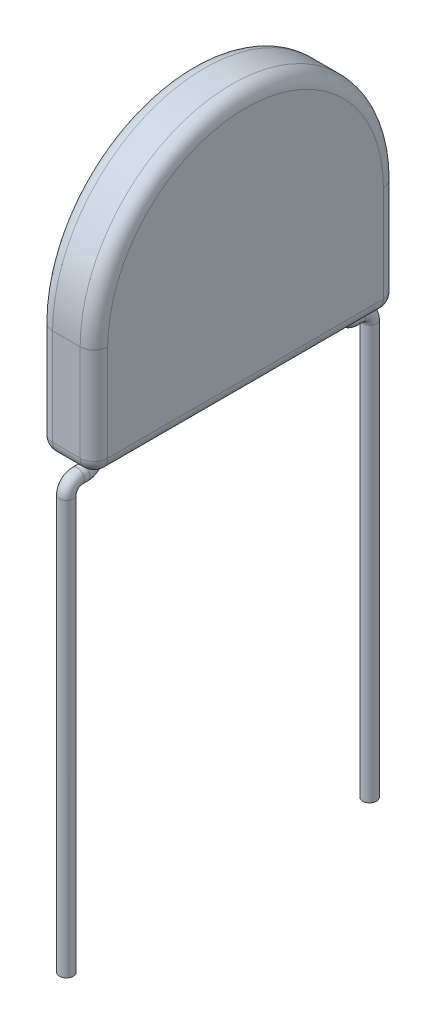
ISO-10303-21;
HEADER;
FILE_DESCRIPTION(('STEP AP214'),'2;1');
FILE_NAME('part.step','',(''),(''),'','','');
FILE_SCHEMA(('AUTOMOTIVE_DESIGN { 1 0 10303 214 1 1 1 1 }'));
ENDSEC;
DATA;
#1=APPLICATION_CONTEXT('core data for automotive mechanical design processes');
#2=APPLICATION_PROTOCOL_DEFINITION('international standard','automotive_design',2000,#1);
#3=PRODUCT_CONTEXT('',#1,'mechanical');
#4=PRODUCT('Part','Part','',(#3));
#5=PRODUCT_RELATED_PRODUCT_CATEGORY('part','',(#4));
#6=PRODUCT_DEFINITION_FORMATION('','',#4);
#7=PRODUCT_DEFINITION_CONTEXT('part definition',#1,'design');
#8=PRODUCT_DEFINITION('design','',#6,#7);
#9=PRODUCT_DEFINITION_SHAPE('','',#8);
#10=(LENGTH_UNIT() NAMED_UNIT(*) SI_UNIT(.MILLI.,.METRE.));
#11=(NAMED_UNIT(*) PLANE_ANGLE_UNIT() SI_UNIT($,.RADIAN.));
#12=(NAMED_UNIT(*) SI_UNIT($,.STERADIAN.) SOLID_ANGLE_UNIT());
#13=UNCERTAINTY_MEASURE_WITH_UNIT(LENGTH_MEASURE(1.E-05),#10,'distance_accuracy_value','');
#14=(GEOMETRIC_REPRESENTATION_CONTEXT(3) GLOBAL_UNCERTAINTY_ASSIGNED_CONTEXT((#13)) GLOBAL_UNIT_ASSIGNED_CONTEXT((#10,
#11,#12)) REPRESENTATION_CONTEXT('',''));
#15=CARTESIAN_POINT('',(0.,0.,0.));
#16=DIRECTION('',(0.,0.,1.));
#17=DIRECTION('',(1.,0.,0.));
#18=AXIS2_PLACEMENT_3D('',#15,#16,#17);
#19=CARTESIAN_POINT('',(1.,0.,0.));
#20=DIRECTION('',(0.,1.,0.));
#21=DIRECTION('',(0.,0.,1.));
#22=AXIS2_PLACEMENT_3D('',#19,#20,#21);
#23=PLANE('',#22);
#24=CARTESIAN_POINT('',(0.5,0.,-5.));
#25=DIRECTION('',(0.,1.,0.));
#26=DIRECTION('',(0.,0.,1.));
#27=AXIS2_PLACEMENT_3D('',#24,#25,#26);
#28=CIRCLE('',#27,0.125);
#29=CARTESIAN_POINT('',(0.5,0.,-4.875));
#30=VERTEX_POINT('',#29);
#31=EDGE_CURVE('E630',#30,#30,#28,.T.);
#32=ORIENTED_EDGE('',*,*,#31,.T.);
#33=EDGE_LOOP('',(#32));
#34=FACE_BOUND('',#33,.T.);
#35=DIRECTION('',(0.,0.,-1.));
#36=VECTOR('',#35,1.);
#37=CARTESIAN_POINT('',(0.25,0.,0.));
#38=LINE('',#37,#36);
#39=CARTESIAN_POINT('',(0.25,0.,-0.25));
#40=VERTEX_POINT('',#39);
#41=CARTESIAN_POINT('',(0.25,0.,-5.25));
#42=VERTEX_POINT('',#41);
#43=EDGE_CURVE('E51',#40,#42,#38,.T.);
#44=ORIENTED_EDGE('',*,*,#43,.T.);
#45=DIRECTION('',(-1.,0.,0.));
#46=VECTOR('',#45,1.);
#47=CARTESIAN_POINT('',(1.,0.,-5.25));
#48=LINE('',#47,#46);
#49=CARTESIAN_POINT('',(0.75,0.,-5.25));
#50=VERTEX_POINT('',#49);
#51=EDGE_CURVE('E44',#42,#50,#48,.F.);
#52=ORIENTED_EDGE('',*,*,#51,.T.);
#53=DIRECTION('',(0.,0.,-1.));
#54=VECTOR('',#53,1.);
#55=CARTESIAN_POINT('',(0.75,0.,0.));
#56=LINE('',#55,#54);
#57=CARTESIAN_POINT('',(0.75,0.,-0.25));
#58=VERTEX_POINT('',#57);
#59=EDGE_CURVE('E59',#50,#58,#56,.F.);
#60=ORIENTED_EDGE('',*,*,#59,.T.);
#61=DIRECTION('',(-1.,0.,0.));
#62=VECTOR('',#61,1.);
#63=CARTESIAN_POINT('',(1.,0.,-0.25));
#64=LINE('',#63,#62);
#65=EDGE_CURVE('E190',#58,#40,#64,.T.);
#66=ORIENTED_EDGE('',*,*,#65,.T.);
#67=EDGE_LOOP('',(#44,#52,#60,#66));
#68=FACE_BOUND('',#67,.T.);
#69=CARTESIAN_POINT('',(0.5,0.,-0.5));
#70=DIRECTION('',(0.,1.,0.));
#71=DIRECTION('',(0.,0.,1.));
#72=AXIS2_PLACEMENT_3D('',#69,#70,#71);
#73=CIRCLE('',#72,0.125);
#74=CARTESIAN_POINT('',(0.5,0.,-0.375));
#75=VERTEX_POINT('',#74);
#76=EDGE_CURVE('E11',#75,#75,#73,.F.);
#77=ORIENTED_EDGE('',*,*,#76,.F.);
#78=EDGE_LOOP('',(#77));
#79=FACE_BOUND('',#78,.T.);
#80=ADVANCED_FACE('F36',(#34,#68,#79),#23,.F.);
#81=CARTESIAN_POINT('',(1.,2.,-2.75));
#82=DIRECTION('',(-1.,0.,0.));
#83=DIRECTION('',(0.,0.,1.));
#84=AXIS2_PLACEMENT_3D('',#81,#82,#83);
#85=CYLINDRICAL_SURFACE('',#84,2.75);
#86=DIRECTION('',(-1.,0.,0.));
#87=VECTOR('',#86,1.);
#88=CARTESIAN_POINT('',(1.,2.,-5.5));
#89=LINE('',#88,#87);
#90=CARTESIAN_POINT('',(0.75,2.,-5.5));
#91=VERTEX_POINT('',#90);
#92=CARTESIAN_POINT('',(0.25,2.,-5.5));
#93=VERTEX_POINT('',#92);
#94=EDGE_CURVE('E137',#91,#93,#89,.T.);
#95=ORIENTED_EDGE('',*,*,#94,.T.);
#96=CARTESIAN_POINT('',(0.25,2.,-2.75));
#97=DIRECTION('',(1.,0.,0.));
#98=DIRECTION('',(0.,0.,-1.));
#99=AXIS2_PLACEMENT_3D('',#96,#97,#98);
#100=CIRCLE('',#99,2.75);
#101=CARTESIAN_POINT('',(0.25,2.,0.));
#102=VERTEX_POINT('',#101);
#103=EDGE_CURVE('E136',#93,#102,#100,.T.);
#104=ORIENTED_EDGE('',*,*,#103,.T.);
#105=DIRECTION('',(-1.,0.,0.));
#106=VECTOR('',#105,1.);
#107=CARTESIAN_POINT('',(1.,2.,0.));
#108=LINE('',#107,#106);
#109=CARTESIAN_POINT('',(0.75,2.,0.));
#110=VERTEX_POINT('',#109);
#111=EDGE_CURVE('E119',#110,#102,#108,.T.);
#112=ORIENTED_EDGE('',*,*,#111,.F.);
#113=CARTESIAN_POINT('',(0.75,2.,-2.75));
#114=DIRECTION('',(1.,0.,0.));
#115=DIRECTION('',(0.,0.,-1.));
#116=AXIS2_PLACEMENT_3D('',#113,#114,#115);
#117=CIRCLE('',#116,2.75);
#118=EDGE_CURVE('E133',#110,#91,#117,.F.);
#119=ORIENTED_EDGE('',*,*,#118,.T.);
#120=EDGE_LOOP('',(#95,#104,#112,#119));
#121=FACE_BOUND('',#120,.T.);
#122=ADVANCED_FACE('F132',(#121),#85,.T.);
#123=CARTESIAN_POINT('',(1.,2.,0.));
#124=DIRECTION('',(0.,0.,-1.));
#125=DIRECTION('',(0.,1.,0.));
#126=AXIS2_PLACEMENT_3D('',#123,#124,#125);
#127=PLANE('',#126);
#128=ORIENTED_EDGE('',*,*,#111,.T.);
#129=DIRECTION('',(0.,-1.,0.));
#130=VECTOR('',#129,1.);
#131=CARTESIAN_POINT('',(0.25,2.,0.));
#132=LINE('',#131,#130);
#133=CARTESIAN_POINT('',(0.25,0.25,0.));
#134=VERTEX_POINT('',#133);
#135=EDGE_CURVE('E127',#102,#134,#132,.T.);
#136=ORIENTED_EDGE('',*,*,#135,.T.);
#137=DIRECTION('',(-1.,0.,0.));
#138=VECTOR('',#137,1.);
#139=CARTESIAN_POINT('',(1.,0.25,0.));
#140=LINE('',#139,#138);
#141=CARTESIAN_POINT('',(0.75,0.25,0.));
#142=VERTEX_POINT('',#141);
#143=EDGE_CURVE('E122',#134,#142,#140,.F.);
#144=ORIENTED_EDGE('',*,*,#143,.T.);
#145=DIRECTION('',(0.,-1.,0.));
#146=VECTOR('',#145,1.);
#147=CARTESIAN_POINT('',(0.75,2.,0.));
#148=LINE('',#147,#146);
#149=EDGE_CURVE('E115',#142,#110,#148,.F.);
#150=ORIENTED_EDGE('',*,*,#149,.T.);
#151=EDGE_LOOP('',(#128,#136,#144,#150));
#152=FACE_BOUND('',#151,.T.);
#153=ADVANCED_FACE('F117',(#152),#127,.F.);
#154=CARTESIAN_POINT('',(1.,0.,-5.5));
#155=DIRECTION('',(0.,0.,1.));
#156=DIRECTION('',(0.,-1.,0.));
#157=AXIS2_PLACEMENT_3D('',#154,#155,#156);
#158=PLANE('',#157);
#159=ORIENTED_EDGE('',*,*,#94,.F.);
#160=DIRECTION('',(0.,1.,0.));
#161=VECTOR('',#160,1.);
#162=CARTESIAN_POINT('',(0.75,0.,-5.5));
#163=LINE('',#162,#161);
#164=CARTESIAN_POINT('',(0.75,0.25,-5.5));
#165=VERTEX_POINT('',#164);
#166=EDGE_CURVE('E188',#91,#165,#163,.F.);
#167=ORIENTED_EDGE('',*,*,#166,.T.);
#168=DIRECTION('',(-1.,0.,0.));
#169=VECTOR('',#168,1.);
#170=CARTESIAN_POINT('',(1.,0.25,-5.5));
#171=LINE('',#170,#169);
#172=CARTESIAN_POINT('',(0.25,0.25,-5.5));
#173=VERTEX_POINT('',#172);
#174=EDGE_CURVE('E184',#165,#173,#171,.T.);
#175=ORIENTED_EDGE('',*,*,#174,.T.);
#176=DIRECTION('',(0.,1.,0.));
#177=VECTOR('',#176,1.);
#178=CARTESIAN_POINT('',(0.25,0.,-5.5));
#179=LINE('',#178,#177);
#180=EDGE_CURVE('E186',#173,#93,#179,.T.);
#181=ORIENTED_EDGE('',*,*,#180,.T.);
#182=EDGE_LOOP('',(#159,#167,#175,#181));
#183=FACE_BOUND('',#182,.T.);
#184=ADVANCED_FACE('F281',(#183),#158,.F.);
#185=CARTESIAN_POINT('',(1.,2.,-2.75));
#186=DIRECTION('',(1.,0.,0.));
#187=DIRECTION('',(0.,0.,-1.));
#188=AXIS2_PLACEMENT_3D('',#185,#186,#187);
#189=PLANE('',#188);
#190=DIRECTION('',(0.,-1.,0.));
#191=VECTOR('',#190,1.);
#192=CARTESIAN_POINT('',(1.,0.,-0.25));
#193=LINE('',#192,#191);
#194=CARTESIAN_POINT('',(1.,2.,-0.249999999999999));
#195=VERTEX_POINT('',#194);
#196=CARTESIAN_POINT('',(1.,0.25,-0.25));
#197=VERTEX_POINT('',#196);
#198=EDGE_CURVE('E150',#195,#197,#193,.T.);
#199=ORIENTED_EDGE('',*,*,#198,.T.);
#200=DIRECTION('',(0.,0.,-1.));
#201=VECTOR('',#200,1.);
#202=CARTESIAN_POINT('',(1.,0.25,-5.5));
#203=LINE('',#202,#201);
#204=CARTESIAN_POINT('',(1.,0.25,-5.25));
#205=VERTEX_POINT('',#204);
#206=EDGE_CURVE('E182',#197,#205,#203,.T.);
#207=ORIENTED_EDGE('',*,*,#206,.T.);
#208=DIRECTION('',(0.,1.,0.));
#209=VECTOR('',#208,1.);
#210=CARTESIAN_POINT('',(1.,2.,-5.25));
#211=LINE('',#210,#209);
#212=CARTESIAN_POINT('',(1.,2.,-5.25));
#213=VERTEX_POINT('',#212);
#214=EDGE_CURVE('E179',#205,#213,#211,.T.);
#215=ORIENTED_EDGE('',*,*,#214,.T.);
#216=CARTESIAN_POINT('',(1.,2.,-2.75));
#217=DIRECTION('',(1.,0.,0.));
#218=DIRECTION('',(0.,0.,-1.));
#219=AXIS2_PLACEMENT_3D('',#216,#217,#218);
#220=CIRCLE('',#219,2.5);
#221=EDGE_CURVE('E176',#213,#195,#220,.T.);
#222=ORIENTED_EDGE('',*,*,#221,.T.);
#223=EDGE_LOOP('',(#199,#207,#215,#222));
#224=FACE_BOUND('',#223,.T.);
#225=ADVANCED_FACE('F534',(#224),#189,.T.);
#226=CARTESIAN_POINT('',(0.,2.,-2.75));
#227=DIRECTION('',(1.,0.,0.));
#228=DIRECTION('',(0.,0.,-1.));
#229=AXIS2_PLACEMENT_3D('',#226,#227,#228);
#230=PLANE('',#229);
#231=DIRECTION('',(0.,0.,-1.));
#232=VECTOR('',#231,1.);
#233=CARTESIAN_POINT('',(0.,0.25,-2.75));
#234=LINE('',#233,#232);
#235=CARTESIAN_POINT('',(0.,0.25,-5.25));
#236=VERTEX_POINT('',#235);
#237=CARTESIAN_POINT('',(0.,0.25,-0.25));
#238=VERTEX_POINT('',#237);
#239=EDGE_CURVE('E167',#236,#238,#234,.F.);
#240=ORIENTED_EDGE('',*,*,#239,.T.);
#241=DIRECTION('',(0.,-1.,0.));
#242=VECTOR('',#241,1.);
#243=CARTESIAN_POINT('',(0.,2.,-0.25));
#244=LINE('',#243,#242);
#245=CARTESIAN_POINT('',(0.,2.,-0.249999999999999));
#246=VERTEX_POINT('',#245);
#247=EDGE_CURVE('E147',#238,#246,#244,.F.);
#248=ORIENTED_EDGE('',*,*,#247,.T.);
#249=CARTESIAN_POINT('',(0.,2.,-2.75));
#250=DIRECTION('',(1.,0.,0.));
#251=DIRECTION('',(0.,0.,-1.));
#252=AXIS2_PLACEMENT_3D('',#249,#250,#251);
#253=CIRCLE('',#252,2.5);
#254=CARTESIAN_POINT('',(0.,2.,-5.25));
#255=VERTEX_POINT('',#254);
#256=EDGE_CURVE('E171',#246,#255,#253,.F.);
#257=ORIENTED_EDGE('',*,*,#256,.T.);
#258=DIRECTION('',(0.,1.,0.));
#259=VECTOR('',#258,1.);
#260=CARTESIAN_POINT('',(0.,2.,-5.25));
#261=LINE('',#260,#259);
#262=EDGE_CURVE('E169',#255,#236,#261,.F.);
#263=ORIENTED_EDGE('',*,*,#262,.T.);
#264=EDGE_LOOP('',(#240,#248,#257,#263));
#265=FACE_BOUND('',#264,.T.);
#266=ADVANCED_FACE('F254',(#265),#230,.F.);
#267=CARTESIAN_POINT('',(0.75,2.,-5.25));
#268=DIRECTION('',(0.,-1.,0.));
#269=DIRECTION('',(0.,0.,-1.));
#270=AXIS2_PLACEMENT_3D('',#267,#268,#269);
#271=CYLINDRICAL_SURFACE('',#270,0.25);
#272=CARTESIAN_POINT('',(0.75,0.25,-5.25));
#273=DIRECTION('',(0.,-1.,0.));
#274=DIRECTION('',(0.,0.,-1.));
#275=AXIS2_PLACEMENT_3D('',#272,#273,#274);
#276=CIRCLE('',#275,0.25);
#277=EDGE_CURVE('E151',#165,#205,#276,.T.);
#278=ORIENTED_EDGE('',*,*,#277,.F.);
#279=ORIENTED_EDGE('',*,*,#166,.F.);
#280=CARTESIAN_POINT('',(0.75,2.,-5.25));
#281=DIRECTION('',(0.,1.,0.));
#282=DIRECTION('',(0.,0.,1.));
#283=AXIS2_PLACEMENT_3D('',#280,#281,#282);
#284=CIRCLE('',#283,0.25);
#285=EDGE_CURVE('E146',#213,#91,#284,.T.);
#286=ORIENTED_EDGE('',*,*,#285,.F.);
#287=ORIENTED_EDGE('',*,*,#214,.F.);
#288=EDGE_LOOP('',(#278,#279,#286,#287));
#289=FACE_BOUND('',#288,.T.);
#290=ADVANCED_FACE('F38',(#289),#271,.T.);
#291=CARTESIAN_POINT('',(0.75,2.,-2.75));
#292=DIRECTION('',(1.,0.,0.));
#293=DIRECTION('',(0.,0.,-1.));
#294=AXIS2_PLACEMENT_3D('',#291,#292,#293);
#295=TOROIDAL_SURFACE('',#294,2.5,0.25);
#296=ORIENTED_EDGE('',*,*,#285,.T.);
#297=ORIENTED_EDGE('',*,*,#118,.F.);
#298=CARTESIAN_POINT('',(0.75,2.,-0.249999999999999));
#299=DIRECTION('',(0.,-1.,0.));
#300=DIRECTION('',(0.,0.,-1.));
#301=AXIS2_PLACEMENT_3D('',#298,#299,#300);
#302=CIRCLE('',#301,0.25);
#303=EDGE_CURVE('E143',#195,#110,#302,.T.);
#304=ORIENTED_EDGE('',*,*,#303,.F.);
#305=ORIENTED_EDGE('',*,*,#221,.F.);
#306=EDGE_LOOP('',(#296,#297,#304,#305));
#307=FACE_BOUND('',#306,.T.);
#308=ADVANCED_FACE('F142',(#307),#295,.T.);
#309=CARTESIAN_POINT('',(0.75,0.25,-5.25));
#310=DIRECTION('',(0.,0.,1.));
#311=DIRECTION('',(1.,0.,0.));
#312=AXIS2_PLACEMENT_3D('',#309,#310,#311);
#313=SPHERICAL_SURFACE('',#312,0.25);
#314=CARTESIAN_POINT('',(0.75,0.25,-5.25));
#315=DIRECTION('',(1.,0.,0.));
#316=DIRECTION('',(0.,0.,-1.));
#317=AXIS2_PLACEMENT_3D('',#314,#315,#316);
#318=CIRCLE('',#317,0.25);
#319=EDGE_CURVE('E156',#165,#50,#318,.F.);
#320=ORIENTED_EDGE('',*,*,#319,.F.);
#321=ORIENTED_EDGE('',*,*,#277,.T.);
#322=CARTESIAN_POINT('',(0.75,0.25,-5.25));
#323=DIRECTION('',(0.,0.,-1.));
#324=DIRECTION('',(-1.,0.,0.));
#325=AXIS2_PLACEMENT_3D('',#322,#323,#324);
#326=CIRCLE('',#325,0.25);
#327=EDGE_CURVE('E152',#50,#205,#326,.F.);
#328=ORIENTED_EDGE('',*,*,#327,.F.);
#329=EDGE_LOOP('',(#320,#321,#328));
#330=FACE_BOUND('',#329,.T.);
#331=ADVANCED_FACE('F505',(#330),#313,.T.);
#332=CARTESIAN_POINT('',(0.75,2.,-0.25));
#333=DIRECTION('',(0.,1.,0.));
#334=DIRECTION('',(0.,0.,1.));
#335=AXIS2_PLACEMENT_3D('',#332,#333,#334);
#336=CYLINDRICAL_SURFACE('',#335,0.25);
#337=ORIENTED_EDGE('',*,*,#303,.T.);
#338=ORIENTED_EDGE('',*,*,#149,.F.);
#339=CARTESIAN_POINT('',(0.75,0.25,-0.25));
#340=DIRECTION('',(0.,-1.,0.));
#341=DIRECTION('',(0.,0.,-1.));
#342=AXIS2_PLACEMENT_3D('',#339,#340,#341);
#343=CIRCLE('',#342,0.25);
#344=EDGE_CURVE('E223',#197,#142,#343,.T.);
#345=ORIENTED_EDGE('',*,*,#344,.F.);
#346=ORIENTED_EDGE('',*,*,#198,.F.);
#347=EDGE_LOOP('',(#337,#338,#345,#346));
#348=FACE_BOUND('',#347,.T.);
#349=ADVANCED_FACE('F149',(#348),#336,.T.);
#350=CARTESIAN_POINT('',(0.75,0.25,-2.75));
#351=DIRECTION('',(0.,0.,1.));
#352=DIRECTION('',(1.,0.,0.));
#353=AXIS2_PLACEMENT_3D('',#350,#351,#352);
#354=CYLINDRICAL_SURFACE('',#353,0.25);
#355=ORIENTED_EDGE('',*,*,#327,.T.);
#356=ORIENTED_EDGE('',*,*,#206,.F.);
#357=CARTESIAN_POINT('',(0.75,0.25,-0.25));
#358=DIRECTION('',(0.,0.,1.));
#359=DIRECTION('',(1.,0.,0.));
#360=AXIS2_PLACEMENT_3D('',#357,#358,#359);
#361=CIRCLE('',#360,0.25);
#362=EDGE_CURVE('E220',#58,#197,#361,.T.);
#363=ORIENTED_EDGE('',*,*,#362,.F.);
#364=ORIENTED_EDGE('',*,*,#59,.F.);
#365=EDGE_LOOP('',(#355,#356,#363,#364));
#366=FACE_BOUND('',#365,.T.);
#367=ADVANCED_FACE('F235',(#366),#354,.T.);
#368=CARTESIAN_POINT('',(1.,0.25,-5.25));
#369=DIRECTION('',(-1.,0.,0.));
#370=DIRECTION('',(0.,0.,1.));
#371=AXIS2_PLACEMENT_3D('',#368,#369,#370);
#372=CYLINDRICAL_SURFACE('',#371,0.25);
#373=ORIENTED_EDGE('',*,*,#319,.T.);
#374=ORIENTED_EDGE('',*,*,#51,.F.);
#375=CARTESIAN_POINT('',(0.25,0.25,-5.25));
#376=DIRECTION('',(-1.,0.,0.));
#377=DIRECTION('',(0.,0.,1.));
#378=AXIS2_PLACEMENT_3D('',#375,#376,#377);
#379=CIRCLE('',#378,0.25);
#380=EDGE_CURVE('E217',#173,#42,#379,.T.);
#381=ORIENTED_EDGE('',*,*,#380,.F.);
#382=ORIENTED_EDGE('',*,*,#174,.F.);
#383=EDGE_LOOP('',(#373,#374,#381,#382));
#384=FACE_BOUND('',#383,.T.);
#385=ADVANCED_FACE('F228',(#384),#372,.T.);
#386=CARTESIAN_POINT('',(0.75,0.25,-0.25));
#387=DIRECTION('',(0.,0.,1.));
#388=DIRECTION('',(1.,0.,0.));
#389=AXIS2_PLACEMENT_3D('',#386,#387,#388);
#390=SPHERICAL_SURFACE('',#389,0.25);
#391=ORIENTED_EDGE('',*,*,#362,.T.);
#392=ORIENTED_EDGE('',*,*,#344,.T.);
#393=CARTESIAN_POINT('',(0.75,0.25,-0.25));
#394=DIRECTION('',(1.,0.,0.));
#395=DIRECTION('',(0.,0.,-1.));
#396=AXIS2_PLACEMENT_3D('',#393,#394,#395);
#397=CIRCLE('',#396,0.25);
#398=EDGE_CURVE('E211',#58,#142,#397,.F.);
#399=ORIENTED_EDGE('',*,*,#398,.F.);
#400=EDGE_LOOP('',(#391,#392,#399));
#401=FACE_BOUND('',#400,.T.);
#402=ADVANCED_FACE('F237',(#401),#390,.T.);
#403=CARTESIAN_POINT('',(0.25,0.25,-5.25));
#404=DIRECTION('',(0.,0.,1.));
#405=DIRECTION('',(1.,0.,0.));
#406=AXIS2_PLACEMENT_3D('',#403,#404,#405);
#407=SPHERICAL_SURFACE('',#406,0.25);
#408=CARTESIAN_POINT('',(0.25,0.25,-5.25));
#409=DIRECTION('',(0.,0.,-1.));
#410=DIRECTION('',(-1.,0.,0.));
#411=AXIS2_PLACEMENT_3D('',#408,#409,#410);
#412=CIRCLE('',#411,0.25);
#413=EDGE_CURVE('E208',#236,#42,#412,.F.);
#414=ORIENTED_EDGE('',*,*,#413,.F.);
#415=CARTESIAN_POINT('',(0.25,0.25,-5.25));
#416=DIRECTION('',(0.,-1.,0.));
#417=DIRECTION('',(0.,0.,-1.));
#418=AXIS2_PLACEMENT_3D('',#415,#416,#417);
#419=CIRCLE('',#418,0.25);
#420=EDGE_CURVE('E214',#173,#236,#419,.F.);
#421=ORIENTED_EDGE('',*,*,#420,.F.);
#422=ORIENTED_EDGE('',*,*,#380,.T.);
#423=EDGE_LOOP('',(#414,#421,#422));
#424=FACE_BOUND('',#423,.T.);
#425=ADVANCED_FACE('F262',(#424),#407,.T.);
#426=CARTESIAN_POINT('',(0.25,0.,-5.25));
#427=DIRECTION('',(0.,1.,0.));
#428=DIRECTION('',(0.,0.,1.));
#429=AXIS2_PLACEMENT_3D('',#426,#427,#428);
#430=CYLINDRICAL_SURFACE('',#429,0.25);
#431=ORIENTED_EDGE('',*,*,#420,.T.);
#432=ORIENTED_EDGE('',*,*,#262,.F.);
#433=CARTESIAN_POINT('',(0.25,2.,-5.25));
#434=DIRECTION('',(0.,1.,0.));
#435=DIRECTION('',(0.,0.,1.));
#436=AXIS2_PLACEMENT_3D('',#433,#434,#435);
#437=CIRCLE('',#436,0.25);
#438=EDGE_CURVE('E205',#93,#255,#437,.T.);
#439=ORIENTED_EDGE('',*,*,#438,.F.);
#440=ORIENTED_EDGE('',*,*,#180,.F.);
#441=EDGE_LOOP('',(#431,#432,#439,#440));
#442=FACE_BOUND('',#441,.T.);
#443=ADVANCED_FACE('F260',(#442),#430,.T.);
#444=CARTESIAN_POINT('',(1.,0.25,-0.25));
#445=DIRECTION('',(-1.,0.,0.));
#446=DIRECTION('',(0.,0.,1.));
#447=AXIS2_PLACEMENT_3D('',#444,#445,#446);
#448=CYLINDRICAL_SURFACE('',#447,0.25);
#449=ORIENTED_EDGE('',*,*,#398,.T.);
#450=ORIENTED_EDGE('',*,*,#143,.F.);
#451=CARTESIAN_POINT('',(0.25,0.25,-0.25));
#452=DIRECTION('',(-1.,0.,0.));
#453=DIRECTION('',(0.,0.,1.));
#454=AXIS2_PLACEMENT_3D('',#451,#452,#453);
#455=CIRCLE('',#454,0.25);
#456=EDGE_CURVE('E202',#40,#134,#455,.T.);
#457=ORIENTED_EDGE('',*,*,#456,.F.);
#458=ORIENTED_EDGE('',*,*,#65,.F.);
#459=EDGE_LOOP('',(#449,#450,#457,#458));
#460=FACE_BOUND('',#459,.T.);
#461=ADVANCED_FACE('F240',(#460),#448,.T.);
#462=CARTESIAN_POINT('',(0.25,0.25,0.));
#463=DIRECTION('',(0.,0.,-1.));
#464=DIRECTION('',(-1.,0.,0.));
#465=AXIS2_PLACEMENT_3D('',#462,#463,#464);
#466=CYLINDRICAL_SURFACE('',#465,0.25);
#467=ORIENTED_EDGE('',*,*,#413,.T.);
#468=ORIENTED_EDGE('',*,*,#43,.F.);
#469=CARTESIAN_POINT('',(0.25,0.25,-0.25));
#470=DIRECTION('',(0.,0.,1.));
#471=DIRECTION('',(1.,0.,0.));
#472=AXIS2_PLACEMENT_3D('',#469,#470,#471);
#473=CIRCLE('',#472,0.25);
#474=EDGE_CURVE('E199',#238,#40,#473,.T.);
#475=ORIENTED_EDGE('',*,*,#474,.F.);
#476=ORIENTED_EDGE('',*,*,#239,.F.);
#477=EDGE_LOOP('',(#467,#468,#475,#476));
#478=FACE_BOUND('',#477,.T.);
#479=ADVANCED_FACE('F248',(#478),#466,.T.);
#480=CARTESIAN_POINT('',(0.25,2.,-2.75));
#481=DIRECTION('',(1.,0.,0.));
#482=DIRECTION('',(0.,0.,-1.));
#483=AXIS2_PLACEMENT_3D('',#480,#481,#482);
#484=TOROIDAL_SURFACE('',#483,2.5,0.25);
#485=ORIENTED_EDGE('',*,*,#438,.T.);
#486=ORIENTED_EDGE('',*,*,#256,.F.);
#487=CARTESIAN_POINT('',(0.25,2.,-0.25));
#488=DIRECTION('',(0.,-1.,0.));
#489=DIRECTION('',(0.,0.,-1.));
#490=AXIS2_PLACEMENT_3D('',#487,#488,#489);
#491=CIRCLE('',#490,0.25);
#492=EDGE_CURVE('E197',#102,#246,#491,.T.);
#493=ORIENTED_EDGE('',*,*,#492,.F.);
#494=ORIENTED_EDGE('',*,*,#103,.F.);
#495=EDGE_LOOP('',(#485,#486,#493,#494));
#496=FACE_BOUND('',#495,.T.);
#497=ADVANCED_FACE('F290',(#496),#484,.T.);
#498=CARTESIAN_POINT('',(0.25,0.25,-0.25));
#499=DIRECTION('',(0.,0.,1.));
#500=DIRECTION('',(1.,0.,0.));
#501=AXIS2_PLACEMENT_3D('',#498,#499,#500);
#502=SPHERICAL_SURFACE('',#501,0.25);
#503=ORIENTED_EDGE('',*,*,#474,.T.);
#504=ORIENTED_EDGE('',*,*,#456,.T.);
#505=CARTESIAN_POINT('',(0.25,0.25,-0.25));
#506=DIRECTION('',(0.,-1.,0.));
#507=DIRECTION('',(0.,0.,-1.));
#508=AXIS2_PLACEMENT_3D('',#505,#506,#507);
#509=CIRCLE('',#508,0.25);
#510=EDGE_CURVE('E195',#238,#134,#509,.F.);
#511=ORIENTED_EDGE('',*,*,#510,.F.);
#512=EDGE_LOOP('',(#503,#504,#511));
#513=FACE_BOUND('',#512,.T.);
#514=ADVANCED_FACE('F244',(#513),#502,.T.);
#515=CARTESIAN_POINT('',(0.25,2.,-0.25));
#516=DIRECTION('',(0.,-1.,0.));
#517=DIRECTION('',(0.,0.,-1.));
#518=AXIS2_PLACEMENT_3D('',#515,#516,#517);
#519=CYLINDRICAL_SURFACE('',#518,0.25);
#520=ORIENTED_EDGE('',*,*,#492,.T.);
#521=ORIENTED_EDGE('',*,*,#247,.F.);
#522=ORIENTED_EDGE('',*,*,#510,.T.);
#523=ORIENTED_EDGE('',*,*,#135,.F.);
#524=EDGE_LOOP('',(#520,#521,#522,#523));
#525=FACE_BOUND('',#524,.T.);
#526=ADVANCED_FACE('F250',(#525),#519,.T.);
#527=CARTESIAN_POINT('',(0.5,-0.45,0.));
#528=DIRECTION('',(0.,-1.,0.));
#529=DIRECTION('',(0.,0.,-1.));
#530=AXIS2_PLACEMENT_3D('',#527,#528,#529);
#531=CYLINDRICAL_SURFACE('',#530,0.125);
#532=CARTESIAN_POINT('',(0.5,-0.45,0.));
#533=DIRECTION('',(0.,-1.,0.));
#534=DIRECTION('',(0.,0.,-1.));
#535=AXIS2_PLACEMENT_3D('',#532,#533,#534);
#536=CIRCLE('',#535,0.125);
#537=CARTESIAN_POINT('',(0.5,-0.45,0.125));
#538=VERTEX_POINT('',#537);
#539=EDGE_CURVE('E613',#538,#538,#536,.T.);
#540=ORIENTED_EDGE('',*,*,#539,.T.);
#541=EDGE_LOOP('',(#540));
#542=FACE_BOUND('',#541,.T.);
#543=CARTESIAN_POINT('',(0.5,-7.95,0.));
#544=DIRECTION('',(0.,-1.,0.));
#545=DIRECTION('',(0.,0.,-1.));
#546=AXIS2_PLACEMENT_3D('',#543,#544,#545);
#547=CIRCLE('',#546,0.125);
#548=CARTESIAN_POINT('',(0.5,-7.95,-0.125000000000001));
#549=VERTEX_POINT('',#548);
#550=EDGE_CURVE('E162',#549,#549,#547,.T.);
#551=ORIENTED_EDGE('',*,*,#550,.F.);
#552=EDGE_LOOP('',(#551));
#553=FACE_BOUND('',#552,.T.);
#554=ADVANCED_FACE('F287',(#542,#553),#531,.T.);
#555=CARTESIAN_POINT('',(0.5,-0.45,-0.2));
#556=DIRECTION('',(1.,0.,0.));
#557=DIRECTION('',(0.,0.,-1.));
#558=AXIS2_PLACEMENT_3D('',#555,#556,#557);
#559=TOROIDAL_SURFACE('',#558,0.2,0.125);
#560=CARTESIAN_POINT('',(0.5,-0.25,-0.2));
#561=DIRECTION('',(0.,0.,1.));
#562=DIRECTION('',(0.,-1.,0.));
#563=AXIS2_PLACEMENT_3D('',#560,#561,#562);
#564=CIRCLE('',#563,0.125);
#565=CARTESIAN_POINT('',(0.5,-0.125,-0.2));
#566=VERTEX_POINT('',#565);
#567=EDGE_CURVE('E611',#566,#566,#564,.T.);
#568=CARTESIAN_POINT('',(0.5,-0.45,-0.2));
#569=DIRECTION('',(1.,0.,0.));
#570=DIRECTION('',(0.,0.,-1.));
#571=AXIS2_PLACEMENT_3D('',#568,#569,#570);
#572=CIRCLE('',#571,0.325);
#573=EDGE_CURVE('',#566,#538,#572,.T.);
#574=ORIENTED_EDGE('',*,*,#567,.T.);
#575=ORIENTED_EDGE('',*,*,#539,.F.);
#576=ORIENTED_EDGE('',*,*,#573,.T.);
#577=ORIENTED_EDGE('',*,*,#573,.F.);
#578=EDGE_LOOP('',(#574,#576,#575,#577));
#579=FACE_BOUND('',#578,.T.);
#580=ADVANCED_FACE('F329',(#579),#559,.T.);
#581=CARTESIAN_POINT('',(0.5,-0.25,-0.3));
#582=DIRECTION('',(0.,0.,1.));
#583=DIRECTION('',(1.,0.,0.));
#584=AXIS2_PLACEMENT_3D('',#581,#582,#583);
#585=CYLINDRICAL_SURFACE('',#584,0.125);
#586=CARTESIAN_POINT('',(0.5,-0.25,-0.3));
#587=DIRECTION('',(0.,0.,1.));
#588=DIRECTION('',(0.,-1.,0.));
#589=AXIS2_PLACEMENT_3D('',#586,#587,#588);
#590=CIRCLE('',#589,0.125);
#591=CARTESIAN_POINT('',(0.5,-0.375,-0.3));
#592=VERTEX_POINT('',#591);
#593=EDGE_CURVE('E602',#592,#592,#590,.T.);
#594=ORIENTED_EDGE('',*,*,#593,.T.);
#595=EDGE_LOOP('',(#594));
#596=FACE_BOUND('',#595,.T.);
#597=ORIENTED_EDGE('',*,*,#567,.F.);
#598=EDGE_LOOP('',(#597));
#599=FACE_BOUND('',#598,.T.);
#600=ADVANCED_FACE('F337',(#596,#599),#585,.T.);
#601=CARTESIAN_POINT('',(0.5,-0.05,-0.3));
#602=DIRECTION('',(-1.,0.,0.));
#603=DIRECTION('',(0.,0.,1.));
#604=AXIS2_PLACEMENT_3D('',#601,#602,#603);
#605=TOROIDAL_SURFACE('',#604,0.2,0.125);
#606=CARTESIAN_POINT('',(0.5,-0.05,-0.5));
#607=DIRECTION('',(0.,-1.,0.));
#608=DIRECTION('',(0.,0.,-1.));
#609=AXIS2_PLACEMENT_3D('',#606,#607,#608);
#610=CIRCLE('',#609,0.125);
#611=CARTESIAN_POINT('',(0.5,-0.05,-0.625));
#612=VERTEX_POINT('',#611);
#613=EDGE_CURVE('E598',#612,#612,#610,.T.);
#614=CARTESIAN_POINT('',(0.5,-0.05,-0.3));
#615=DIRECTION('',(-1.,0.,0.));
#616=DIRECTION('',(0.,0.,1.));
#617=AXIS2_PLACEMENT_3D('',#614,#615,#616);
#618=CIRCLE('',#617,0.325);
#619=EDGE_CURVE('',#612,#592,#618,.T.);
#620=ORIENTED_EDGE('',*,*,#613,.T.);
#621=ORIENTED_EDGE('',*,*,#593,.F.);
#622=ORIENTED_EDGE('',*,*,#619,.T.);
#623=ORIENTED_EDGE('',*,*,#619,.F.);
#624=EDGE_LOOP('',(#620,#622,#621,#623));
#625=FACE_BOUND('',#624,.T.);
#626=ADVANCED_FACE('F345',(#625),#605,.T.);
#627=CARTESIAN_POINT('',(0.5,-0.05,-0.5));
#628=DIRECTION('',(0.,1.,0.));
#629=DIRECTION('',(0.,0.,1.));
#630=AXIS2_PLACEMENT_3D('',#627,#628,#629);
#631=CYLINDRICAL_SURFACE('',#630,0.125);
#632=ORIENTED_EDGE('',*,*,#613,.F.);
#633=EDGE_LOOP('',(#632));
#634=FACE_BOUND('',#633,.T.);
#635=ORIENTED_EDGE('',*,*,#76,.T.);
#636=EDGE_LOOP('',(#635));
#637=FACE_BOUND('',#636,.T.);
#638=ADVANCED_FACE('F353',(#634,#637),#631,.T.);
#639=CARTESIAN_POINT('',(0.5,-7.95,0.));
#640=DIRECTION('',(0.,-1.,0.));
#641=DIRECTION('',(0.,0.,-1.));
#642=AXIS2_PLACEMENT_3D('',#639,#640,#641);
#643=PLANE('',#642);
#644=ORIENTED_EDGE('',*,*,#550,.T.);
#645=EDGE_LOOP('',(#644));
#646=FACE_BOUND('',#645,.T.);
#647=ADVANCED_FACE('F361',(#646),#643,.T.);
#648=CARTESIAN_POINT('',(0.5,-0.45,-5.5));
#649=DIRECTION('',(0.,-1.,0.));
#650=DIRECTION('',(0.,0.,-1.));
#651=AXIS2_PLACEMENT_3D('',#648,#649,#650);
#652=CYLINDRICAL_SURFACE('',#651,0.125);
#653=CARTESIAN_POINT('',(0.5,-0.45,-5.5));
#654=DIRECTION('',(0.,1.,0.));
#655=DIRECTION('',(0.,0.,1.));
#656=AXIS2_PLACEMENT_3D('',#653,#654,#655);
#657=CIRCLE('',#656,0.125);
#658=CARTESIAN_POINT('',(0.5,-0.45,-5.625));
#659=VERTEX_POINT('',#658);
#660=EDGE_CURVE('E599',#659,#659,#657,.T.);
#661=ORIENTED_EDGE('',*,*,#660,.F.);
#662=EDGE_LOOP('',(#661));
#663=FACE_BOUND('',#662,.T.);
#664=CARTESIAN_POINT('',(0.5,-7.95,-5.5));
#665=DIRECTION('',(0.,1.,0.));
#666=DIRECTION('',(0.,0.,1.));
#667=AXIS2_PLACEMENT_3D('',#664,#665,#666);
#668=CIRCLE('',#667,0.125);
#669=CARTESIAN_POINT('',(0.5,-7.95,-5.375));
#670=VERTEX_POINT('',#669);
#671=EDGE_CURVE('E596',#670,#670,#668,.T.);
#672=ORIENTED_EDGE('',*,*,#671,.T.);
#673=EDGE_LOOP('',(#672));
#674=FACE_BOUND('',#673,.T.);
#675=ADVANCED_FACE('F369',(#663,#674),#652,.T.);
#676=CARTESIAN_POINT('',(0.5,-0.45,-5.3));
#677=DIRECTION('',(-1.,0.,0.));
#678=DIRECTION('',(0.,0.,1.));
#679=AXIS2_PLACEMENT_3D('',#676,#677,#678);
#680=TOROIDAL_SURFACE('',#679,0.2,0.125);
#681=CARTESIAN_POINT('',(0.5,-0.25,-5.3));
#682=DIRECTION('',(0.,0.,1.));
#683=DIRECTION('',(0.,-1.,0.));
#684=AXIS2_PLACEMENT_3D('',#681,#682,#683);
#685=CIRCLE('',#684,0.125);
#686=CARTESIAN_POINT('',(0.5,-0.125,-5.3));
#687=VERTEX_POINT('',#686);
#688=EDGE_CURVE('E605',#687,#687,#685,.T.);
#689=CARTESIAN_POINT('',(0.5,-0.45,-5.3));
#690=DIRECTION('',(-1.,0.,0.));
#691=DIRECTION('',(0.,0.,1.));
#692=AXIS2_PLACEMENT_3D('',#689,#690,#691);
#693=CIRCLE('',#692,0.325);
#694=EDGE_CURVE('',#687,#659,#693,.T.);
#695=ORIENTED_EDGE('',*,*,#688,.F.);
#696=ORIENTED_EDGE('',*,*,#660,.T.);
#697=ORIENTED_EDGE('',*,*,#694,.T.);
#698=ORIENTED_EDGE('',*,*,#694,.F.);
#699=EDGE_LOOP('',(#695,#697,#696,#698));
#700=FACE_BOUND('',#699,.T.);
#701=ADVANCED_FACE('F377',(#700),#680,.T.);
#702=CARTESIAN_POINT('',(0.5,-0.25,-5.2));
#703=DIRECTION('',(0.,0.,-1.));
#704=DIRECTION('',(-1.,0.,0.));
#705=AXIS2_PLACEMENT_3D('',#702,#703,#704);
#706=CYLINDRICAL_SURFACE('',#705,0.125);
#707=CARTESIAN_POINT('',(0.5,-0.25,-5.2));
#708=DIRECTION('',(0.,0.,1.));
#709=DIRECTION('',(0.,-1.,0.));
#710=AXIS2_PLACEMENT_3D('',#707,#708,#709);
#711=CIRCLE('',#710,0.125);
#712=CARTESIAN_POINT('',(0.5,-0.375000000000001,-5.2));
#713=VERTEX_POINT('',#712);
#714=EDGE_CURVE('E626',#713,#713,#711,.T.);
#715=ORIENTED_EDGE('',*,*,#714,.F.);
#716=EDGE_LOOP('',(#715));
#717=FACE_BOUND('',#716,.T.);
#718=ORIENTED_EDGE('',*,*,#688,.T.);
#719=EDGE_LOOP('',(#718));
#720=FACE_BOUND('',#719,.T.);
#721=ADVANCED_FACE('F385',(#717,#720),#706,.T.);
#722=CARTESIAN_POINT('',(0.5,-0.05,-5.2));
#723=DIRECTION('',(1.,0.,0.));
#724=DIRECTION('',(0.,0.,-1.));
#725=AXIS2_PLACEMENT_3D('',#722,#723,#724);
#726=TOROIDAL_SURFACE('',#725,0.200000000000001,0.125);
#727=CARTESIAN_POINT('',(0.5,-0.05,-5.));
#728=DIRECTION('',(0.,1.,0.));
#729=DIRECTION('',(0.,0.,1.));
#730=AXIS2_PLACEMENT_3D('',#727,#728,#729);
#731=CIRCLE('',#730,0.125);
#732=CARTESIAN_POINT('',(0.5,-0.05,-4.875));
#733=VERTEX_POINT('',#732);
#734=EDGE_CURVE('E629',#733,#733,#731,.T.);
#735=CARTESIAN_POINT('',(0.5,-0.05,-5.2));
#736=DIRECTION('',(1.,0.,0.));
#737=DIRECTION('',(0.,0.,-1.));
#738=AXIS2_PLACEMENT_3D('',#735,#736,#737);
#739=CIRCLE('',#738,0.325000000000001);
#740=EDGE_CURVE('',#733,#713,#739,.T.);
#741=ORIENTED_EDGE('',*,*,#734,.F.);
#742=ORIENTED_EDGE('',*,*,#714,.T.);
#743=ORIENTED_EDGE('',*,*,#740,.T.);
#744=ORIENTED_EDGE('',*,*,#740,.F.);
#745=EDGE_LOOP('',(#741,#743,#742,#744));
#746=FACE_BOUND('',#745,.T.);
#747=ADVANCED_FACE('F393',(#746),#726,.T.);
#748=CARTESIAN_POINT('',(0.5,-0.05,-5.));
#749=DIRECTION('',(0.,1.,0.));
#750=DIRECTION('',(0.,0.,1.));
#751=AXIS2_PLACEMENT_3D('',#748,#749,#750);
#752=CYLINDRICAL_SURFACE('',#751,0.125);
#753=ORIENTED_EDGE('',*,*,#734,.T.);
#754=EDGE_LOOP('',(#753));
#755=FACE_BOUND('',#754,.T.);
#756=ORIENTED_EDGE('',*,*,#31,.F.);
#757=EDGE_LOOP('',(#756));
#758=FACE_BOUND('',#757,.T.);
#759=ADVANCED_FACE('F401',(#755,#758),#752,.T.);
#760=CARTESIAN_POINT('',(0.5,-7.95,-5.5));
#761=DIRECTION('',(0.,-1.,0.));
#762=DIRECTION('',(0.,0.,1.));
#763=AXIS2_PLACEMENT_3D('',#760,#761,#762);
#764=PLANE('',#763);
#765=ORIENTED_EDGE('',*,*,#671,.F.);
#766=EDGE_LOOP('',(#765));
#767=FACE_BOUND('',#766,.T.);
#768=ADVANCED_FACE('F409',(#767),#764,.T.);
#769=CLOSED_SHELL('',(#80,#122,#153,#184,#225,#266,#290,#308,#331,#349,#367,#385,#402,#425,#443,
#461,#479,#497,#514,#526,#554,#580,#600,#626,#638,#647,#675,#701,#721,#747,#759,#768));
#770=MANIFOLD_SOLID_BREP('B2',#769);
#771=ADVANCED_BREP_SHAPE_REPRESENTATION('',(#18,#770),#14);
#772=SHAPE_DEFINITION_REPRESENTATION(#9,#771);
ENDSEC;
END-ISO-10303-21;
